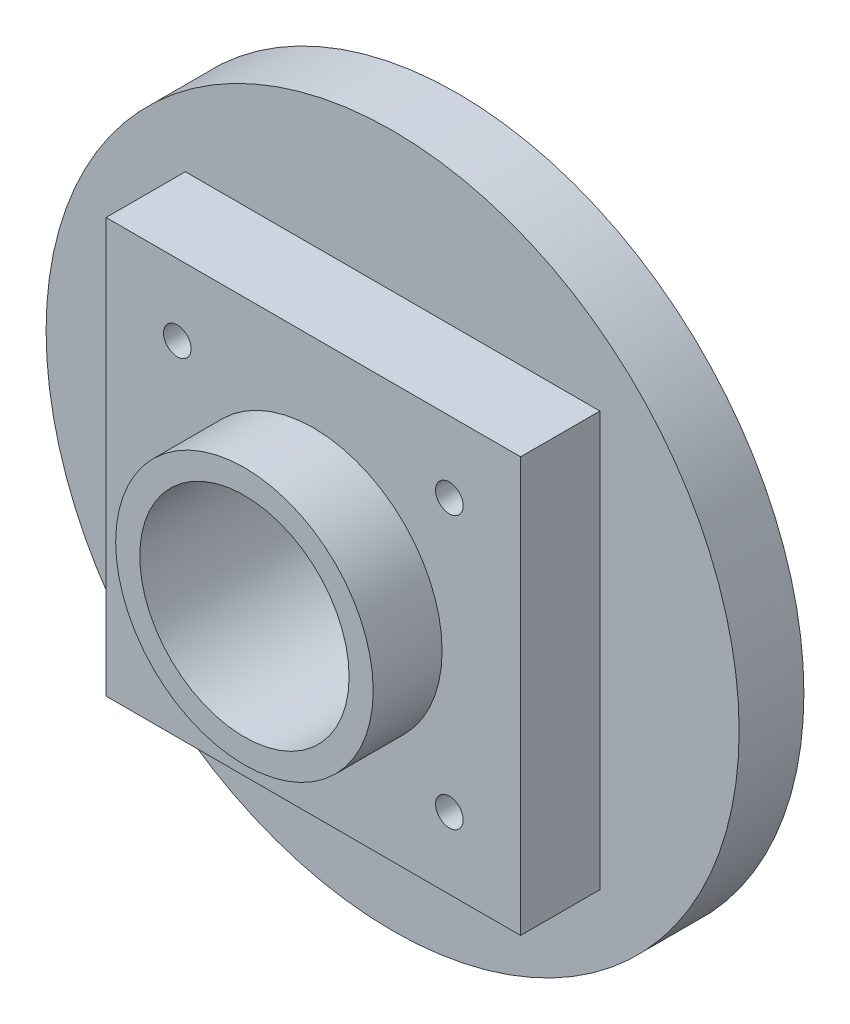
ISO-10303-21;
HEADER;
FILE_DESCRIPTION(('STEP AP214'),'2;1');
FILE_NAME('part.step','',(''),(''),'','','');
FILE_SCHEMA(('AUTOMOTIVE_DESIGN { 1 0 10303 214 1 1 1 1 }'));
ENDSEC;
DATA;
#1=APPLICATION_CONTEXT('core data for automotive mechanical design processes');
#2=APPLICATION_PROTOCOL_DEFINITION('international standard','automotive_design',2000,#1);
#3=PRODUCT_CONTEXT('',#1,'mechanical');
#4=PRODUCT('Part','Part','',(#3));
#5=PRODUCT_RELATED_PRODUCT_CATEGORY('part','',(#4));
#6=PRODUCT_DEFINITION_FORMATION('','',#4);
#7=PRODUCT_DEFINITION_CONTEXT('part definition',#1,'design');
#8=PRODUCT_DEFINITION('design','',#6,#7);
#9=PRODUCT_DEFINITION_SHAPE('','',#8);
#10=(LENGTH_UNIT() NAMED_UNIT(*) SI_UNIT(.MILLI.,.METRE.));
#11=(NAMED_UNIT(*) PLANE_ANGLE_UNIT() SI_UNIT($,.RADIAN.));
#12=(NAMED_UNIT(*) SI_UNIT($,.STERADIAN.) SOLID_ANGLE_UNIT());
#13=UNCERTAINTY_MEASURE_WITH_UNIT(LENGTH_MEASURE(1.E-05),#10,'distance_accuracy_value','');
#14=(GEOMETRIC_REPRESENTATION_CONTEXT(3) GLOBAL_UNCERTAINTY_ASSIGNED_CONTEXT((#13)) GLOBAL_UNIT_ASSIGNED_CONTEXT((#10,
#11,#12)) REPRESENTATION_CONTEXT('',''));
#15=CARTESIAN_POINT('',(0.,0.,0.));
#16=DIRECTION('',(0.,0.,1.));
#17=DIRECTION('',(1.,0.,0.));
#18=AXIS2_PLACEMENT_3D('',#15,#16,#17);
#19=CARTESIAN_POINT('',(0.,0.,14.1224));
#20=DIRECTION('',(0.,0.,1.));
#21=DIRECTION('',(1.,0.,0.));
#22=AXIS2_PLACEMENT_3D('',#19,#20,#21);
#23=PLANE('',#22);
#24=DIRECTION('',(0.,-1.,0.));
#25=VECTOR('',#24,1.);
#26=CARTESIAN_POINT('',(-20.32,20.32,14.1224));
#27=LINE('',#26,#25);
#28=CARTESIAN_POINT('',(-20.32,20.32,14.1224));
#29=VERTEX_POINT('',#28);
#30=CARTESIAN_POINT('',(-20.32,-20.32,14.1224));
#31=VERTEX_POINT('',#30);
#32=EDGE_CURVE('E133',#29,#31,#27,.T.);
#33=ORIENTED_EDGE('',*,*,#32,.T.);
#34=DIRECTION('',(1.,0.,0.));
#35=VECTOR('',#34,1.);
#36=CARTESIAN_POINT('',(-20.32,-20.32,14.1224));
#37=LINE('',#36,#35);
#38=CARTESIAN_POINT('',(20.32,-20.32,14.1224));
#39=VERTEX_POINT('',#38);
#40=EDGE_CURVE('E81',#31,#39,#37,.T.);
#41=ORIENTED_EDGE('',*,*,#40,.T.);
#42=DIRECTION('',(0.,1.,0.));
#43=VECTOR('',#42,1.);
#44=CARTESIAN_POINT('',(20.32,20.32,14.1224));
#45=LINE('',#44,#43);
#46=CARTESIAN_POINT('',(20.32,20.32,14.1224));
#47=VERTEX_POINT('',#46);
#48=EDGE_CURVE('E136',#39,#47,#45,.T.);
#49=ORIENTED_EDGE('',*,*,#48,.T.);
#50=DIRECTION('',(-1.,0.,0.));
#51=VECTOR('',#50,1.);
#52=CARTESIAN_POINT('',(-20.32,20.32,14.1224));
#53=LINE('',#52,#51);
#54=EDGE_CURVE('E59',#47,#29,#53,.T.);
#55=ORIENTED_EDGE('',*,*,#54,.T.);
#56=EDGE_LOOP('',(#33,#41,#49,#55));
#57=FACE_BOUND('',#56,.T.);
#58=CARTESIAN_POINT('',(-13.335,-13.335,14.1224));
#59=DIRECTION('',(0.,0.,1.));
#60=DIRECTION('',(1.,0.,0.));
#61=AXIS2_PLACEMENT_3D('',#58,#59,#60);
#62=CIRCLE('',#61,1.35254999999999);
#63=CARTESIAN_POINT('',(-11.98245,-13.335,14.1224));
#64=VERTEX_POINT('',#63);
#65=EDGE_CURVE('E123',#64,#64,#62,.T.);
#66=ORIENTED_EDGE('',*,*,#65,.F.);
#67=EDGE_LOOP('',(#66));
#68=FACE_BOUND('',#67,.T.);
#69=CARTESIAN_POINT('',(13.335,-13.335,14.1224));
#70=DIRECTION('',(0.,0.,1.));
#71=DIRECTION('',(1.,0.,0.));
#72=AXIS2_PLACEMENT_3D('',#69,#70,#71);
#73=CIRCLE('',#72,1.35254999999999);
#74=CARTESIAN_POINT('',(14.68755,-13.335,14.1224));
#75=VERTEX_POINT('',#74);
#76=EDGE_CURVE('E117',#75,#75,#73,.T.);
#77=ORIENTED_EDGE('',*,*,#76,.F.);
#78=EDGE_LOOP('',(#77));
#79=FACE_BOUND('',#78,.T.);
#80=CARTESIAN_POINT('',(13.335,13.335,14.1224));
#81=DIRECTION('',(0.,0.,1.));
#82=DIRECTION('',(1.,0.,0.));
#83=AXIS2_PLACEMENT_3D('',#80,#81,#82);
#84=CIRCLE('',#83,1.35254999999999);
#85=CARTESIAN_POINT('',(14.68755,13.335,14.1224));
#86=VERTEX_POINT('',#85);
#87=EDGE_CURVE('E104',#86,#86,#84,.T.);
#88=ORIENTED_EDGE('',*,*,#87,.F.);
#89=EDGE_LOOP('',(#88));
#90=FACE_BOUND('',#89,.T.);
#91=CARTESIAN_POINT('',(-13.335,13.335,14.1224));
#92=DIRECTION('',(0.,0.,1.));
#93=DIRECTION('',(1.,0.,0.));
#94=AXIS2_PLACEMENT_3D('',#91,#92,#93);
#95=CIRCLE('',#94,1.35254999999999);
#96=CARTESIAN_POINT('',(-11.98245,13.335,14.1224));
#97=VERTEX_POINT('',#96);
#98=EDGE_CURVE('E105',#97,#97,#95,.T.);
#99=ORIENTED_EDGE('',*,*,#98,.F.);
#100=EDGE_LOOP('',(#99));
#101=FACE_BOUND('',#100,.T.);
#102=CARTESIAN_POINT('',(0.,0.,14.1224));
#103=DIRECTION('',(0.,0.,1.));
#104=DIRECTION('',(1.,0.,0.));
#105=AXIS2_PLACEMENT_3D('',#102,#103,#104);
#106=CIRCLE('',#105,12.6238);
#107=CARTESIAN_POINT('',(12.6238,0.,14.1224));
#108=VERTEX_POINT('',#107);
#109=EDGE_CURVE('E219',#108,#108,#106,.T.);
#110=ORIENTED_EDGE('',*,*,#109,.F.);
#111=EDGE_LOOP('',(#110));
#112=FACE_BOUND('',#111,.T.);
#113=ADVANCED_FACE('F36',(#57,#68,#79,#90,#101,#112),#23,.T.);
#114=CARTESIAN_POINT('',(0.,0.,6.35));
#115=DIRECTION('',(0.,0.,1.));
#116=DIRECTION('',(1.,0.,0.));
#117=AXIS2_PLACEMENT_3D('',#114,#115,#116);
#118=PLANE('',#117);
#119=CARTESIAN_POINT('',(0.,0.,6.35));
#120=DIRECTION('',(0.,0.,1.));
#121=DIRECTION('',(1.,0.,0.));
#122=AXIS2_PLACEMENT_3D('',#119,#120,#121);
#123=CIRCLE('',#122,33.9725);
#124=CARTESIAN_POINT('',(33.9725,0.,6.35));
#125=VERTEX_POINT('',#124);
#126=EDGE_CURVE('E44',#125,#125,#123,.T.);
#127=ORIENTED_EDGE('',*,*,#126,.T.);
#128=EDGE_LOOP('',(#127));
#129=FACE_BOUND('',#128,.T.);
#130=DIRECTION('',(1.,0.,0.));
#131=VECTOR('',#130,1.);
#132=CARTESIAN_POINT('',(-20.32,-20.32,6.35));
#133=LINE('',#132,#131);
#134=CARTESIAN_POINT('',(-20.32,-20.32,6.35));
#135=VERTEX_POINT('',#134);
#136=CARTESIAN_POINT('',(20.32,-20.32,6.35));
#137=VERTEX_POINT('',#136);
#138=EDGE_CURVE('E142',#135,#137,#133,.T.);
#139=ORIENTED_EDGE('',*,*,#138,.F.);
#140=DIRECTION('',(0.,-1.,0.));
#141=VECTOR('',#140,1.);
#142=CARTESIAN_POINT('',(-20.32,20.32,6.35));
#143=LINE('',#142,#141);
#144=CARTESIAN_POINT('',(-20.32,20.32,6.35));
#145=VERTEX_POINT('',#144);
#146=EDGE_CURVE('E132',#145,#135,#143,.T.);
#147=ORIENTED_EDGE('',*,*,#146,.F.);
#148=DIRECTION('',(-1.,0.,0.));
#149=VECTOR('',#148,1.);
#150=CARTESIAN_POINT('',(-20.32,20.32,6.35));
#151=LINE('',#150,#149);
#152=CARTESIAN_POINT('',(20.32,20.32,6.35));
#153=VERTEX_POINT('',#152);
#154=EDGE_CURVE('E74',#153,#145,#151,.T.);
#155=ORIENTED_EDGE('',*,*,#154,.F.);
#156=DIRECTION('',(0.,1.,0.));
#157=VECTOR('',#156,1.);
#158=CARTESIAN_POINT('',(20.32,20.32,6.35));
#159=LINE('',#158,#157);
#160=EDGE_CURVE('E144',#137,#153,#159,.T.);
#161=ORIENTED_EDGE('',*,*,#160,.F.);
#162=EDGE_LOOP('',(#139,#147,#155,#161));
#163=FACE_BOUND('',#162,.T.);
#164=ADVANCED_FACE('F174',(#129,#163),#118,.T.);
#165=CARTESIAN_POINT('',(0.,0.,6.35));
#166=DIRECTION('',(0.,0.,-1.));
#167=DIRECTION('',(-1.,0.,0.));
#168=AXIS2_PLACEMENT_3D('',#165,#166,#167);
#169=CYLINDRICAL_SURFACE('',#168,33.9725);
#170=ORIENTED_EDGE('',*,*,#126,.F.);
#171=EDGE_LOOP('',(#170));
#172=FACE_BOUND('',#171,.T.);
#173=CARTESIAN_POINT('',(0.,0.,0.));
#174=DIRECTION('',(0.,0.,1.));
#175=DIRECTION('',(1.,0.,0.));
#176=AXIS2_PLACEMENT_3D('',#173,#174,#175);
#177=CIRCLE('',#176,33.9725);
#178=CARTESIAN_POINT('',(33.9725,0.,0.));
#179=VERTEX_POINT('',#178);
#180=EDGE_CURVE('E157',#179,#179,#177,.T.);
#181=ORIENTED_EDGE('',*,*,#180,.T.);
#182=EDGE_LOOP('',(#181));
#183=FACE_BOUND('',#182,.T.);
#184=ADVANCED_FACE('F38',(#172,#183),#169,.T.);
#185=CARTESIAN_POINT('',(0.,0.,0.));
#186=DIRECTION('',(0.,0.,1.));
#187=DIRECTION('',(1.,0.,0.));
#188=AXIS2_PLACEMENT_3D('',#185,#186,#187);
#189=PLANE('',#188);
#190=CARTESIAN_POINT('',(0.,0.,0.));
#191=DIRECTION('',(0.,0.,1.));
#192=DIRECTION('',(1.,0.,0.));
#193=AXIS2_PLACEMENT_3D('',#190,#191,#192);
#194=CIRCLE('',#193,17.145);
#195=CARTESIAN_POINT('',(17.145,0.,0.));
#196=VERTEX_POINT('',#195);
#197=EDGE_CURVE('E11',#196,#196,#194,.F.);
#198=ORIENTED_EDGE('',*,*,#197,.F.);
#199=EDGE_LOOP('',(#198));
#200=FACE_BOUND('',#199,.T.);
#201=ORIENTED_EDGE('',*,*,#180,.F.);
#202=EDGE_LOOP('',(#201));
#203=FACE_BOUND('',#202,.T.);
#204=ADVANCED_FACE('F163',(#200,#203),#189,.F.);
#205=CARTESIAN_POINT('',(0.,0.,-6.985));
#206=DIRECTION('',(0.,0.,1.));
#207=DIRECTION('',(1.,0.,0.));
#208=AXIS2_PLACEMENT_3D('',#205,#206,#207);
#209=CYLINDRICAL_SURFACE('',#208,17.145);
#210=CARTESIAN_POINT('',(0.,0.,-6.985));
#211=DIRECTION('',(0.,0.,-1.));
#212=DIRECTION('',(-1.,0.,0.));
#213=AXIS2_PLACEMENT_3D('',#210,#211,#212);
#214=CIRCLE('',#213,17.145);
#215=CARTESIAN_POINT('',(-17.145,0.,-6.985));
#216=VERTEX_POINT('',#215);
#217=EDGE_CURVE('E154',#216,#216,#214,.T.);
#218=ORIENTED_EDGE('',*,*,#217,.F.);
#219=EDGE_LOOP('',(#218));
#220=FACE_BOUND('',#219,.T.);
#221=ORIENTED_EDGE('',*,*,#197,.T.);
#222=EDGE_LOOP('',(#221));
#223=FACE_BOUND('',#222,.T.);
#224=ADVANCED_FACE('F165',(#220,#223),#209,.T.);
#225=CARTESIAN_POINT('',(0.,0.,-6.985));
#226=DIRECTION('',(0.,0.,-1.));
#227=DIRECTION('',(-1.,0.,0.));
#228=AXIS2_PLACEMENT_3D('',#225,#226,#227);
#229=PLANE('',#228);
#230=CARTESIAN_POINT('',(0.,0.,-6.985));
#231=DIRECTION('',(0.,0.,1.));
#232=DIRECTION('',(1.,0.,0.));
#233=AXIS2_PLACEMENT_3D('',#230,#231,#232);
#234=CIRCLE('',#233,10.2616);
#235=CARTESIAN_POINT('',(10.2616,0.,-6.985));
#236=VERTEX_POINT('',#235);
#237=EDGE_CURVE('E129',#236,#236,#234,.T.);
#238=ORIENTED_EDGE('',*,*,#237,.T.);
#239=EDGE_LOOP('',(#238));
#240=FACE_BOUND('',#239,.T.);
#241=ORIENTED_EDGE('',*,*,#217,.T.);
#242=EDGE_LOOP('',(#241));
#243=FACE_BOUND('',#242,.T.);
#244=ADVANCED_FACE('F171',(#240,#243),#229,.T.);
#245=CARTESIAN_POINT('',(-20.32,20.32,14.1224));
#246=DIRECTION('',(1.,0.,0.));
#247=DIRECTION('',(0.,0.,-1.));
#248=AXIS2_PLACEMENT_3D('',#245,#246,#247);
#249=PLANE('',#248);
#250=ORIENTED_EDGE('',*,*,#146,.T.);
#251=DIRECTION('',(0.,0.,-1.));
#252=VECTOR('',#251,1.);
#253=CARTESIAN_POINT('',(-20.32,-20.32,14.1224));
#254=LINE('',#253,#252);
#255=EDGE_CURVE('E152',#31,#135,#254,.T.);
#256=ORIENTED_EDGE('',*,*,#255,.F.);
#257=ORIENTED_EDGE('',*,*,#32,.F.);
#258=DIRECTION('',(0.,0.,-1.));
#259=VECTOR('',#258,1.);
#260=CARTESIAN_POINT('',(-20.32,20.32,14.1224));
#261=LINE('',#260,#259);
#262=EDGE_CURVE('E139',#29,#145,#261,.T.);
#263=ORIENTED_EDGE('',*,*,#262,.T.);
#264=EDGE_LOOP('',(#250,#256,#257,#263));
#265=FACE_BOUND('',#264,.T.);
#266=ADVANCED_FACE('F199',(#265),#249,.F.);
#267=CARTESIAN_POINT('',(-20.32,-20.32,14.1224));
#268=DIRECTION('',(0.,1.,0.));
#269=DIRECTION('',(-1.,0.,0.));
#270=AXIS2_PLACEMENT_3D('',#267,#268,#269);
#271=PLANE('',#270);
#272=ORIENTED_EDGE('',*,*,#138,.T.);
#273=DIRECTION('',(0.,0.,-1.));
#274=VECTOR('',#273,1.);
#275=CARTESIAN_POINT('',(20.32,-20.32,14.1224));
#276=LINE('',#275,#274);
#277=EDGE_CURVE('E149',#39,#137,#276,.T.);
#278=ORIENTED_EDGE('',*,*,#277,.F.);
#279=ORIENTED_EDGE('',*,*,#40,.F.);
#280=ORIENTED_EDGE('',*,*,#255,.T.);
#281=EDGE_LOOP('',(#272,#278,#279,#280));
#282=FACE_BOUND('',#281,.T.);
#283=ADVANCED_FACE('F195',(#282),#271,.F.);
#284=CARTESIAN_POINT('',(20.32,20.32,14.1224));
#285=DIRECTION('',(-1.,0.,0.));
#286=DIRECTION('',(0.,-1.,0.));
#287=AXIS2_PLACEMENT_3D('',#284,#285,#286);
#288=PLANE('',#287);
#289=ORIENTED_EDGE('',*,*,#160,.T.);
#290=DIRECTION('',(0.,0.,-1.));
#291=VECTOR('',#290,1.);
#292=CARTESIAN_POINT('',(20.32,20.32,14.1224));
#293=LINE('',#292,#291);
#294=EDGE_CURVE('E51',#47,#153,#293,.T.);
#295=ORIENTED_EDGE('',*,*,#294,.F.);
#296=ORIENTED_EDGE('',*,*,#48,.F.);
#297=ORIENTED_EDGE('',*,*,#277,.T.);
#298=EDGE_LOOP('',(#289,#295,#296,#297));
#299=FACE_BOUND('',#298,.T.);
#300=ADVANCED_FACE('F192',(#299),#288,.F.);
#301=CARTESIAN_POINT('',(-20.32,20.32,14.1224));
#302=DIRECTION('',(0.,-1.,0.));
#303=DIRECTION('',(1.,0.,0.));
#304=AXIS2_PLACEMENT_3D('',#301,#302,#303);
#305=PLANE('',#304);
#306=ORIENTED_EDGE('',*,*,#154,.T.);
#307=ORIENTED_EDGE('',*,*,#262,.F.);
#308=ORIENTED_EDGE('',*,*,#54,.F.);
#309=ORIENTED_EDGE('',*,*,#294,.T.);
#310=EDGE_LOOP('',(#306,#307,#308,#309));
#311=FACE_BOUND('',#310,.T.);
#312=ADVANCED_FACE('F189',(#311),#305,.F.);
#313=CARTESIAN_POINT('',(0.,0.,-6.985));
#314=DIRECTION('',(0.,0.,1.));
#315=DIRECTION('',(1.,0.,0.));
#316=AXIS2_PLACEMENT_3D('',#313,#314,#315);
#317=CYLINDRICAL_SURFACE('',#316,10.2616);
#318=ORIENTED_EDGE('',*,*,#237,.F.);
#319=EDGE_LOOP('',(#318));
#320=FACE_BOUND('',#319,.T.);
#321=CARTESIAN_POINT('',(0.,0.,20.8788));
#322=DIRECTION('',(0.,0.,1.));
#323=DIRECTION('',(1.,0.,0.));
#324=AXIS2_PLACEMENT_3D('',#321,#322,#323);
#325=CIRCLE('',#324,10.2616);
#326=CARTESIAN_POINT('',(10.2616,0.,20.8788));
#327=VERTEX_POINT('',#326);
#328=EDGE_CURVE('E217',#327,#327,#325,.T.);
#329=ORIENTED_EDGE('',*,*,#328,.T.);
#330=EDGE_LOOP('',(#329));
#331=FACE_BOUND('',#330,.T.);
#332=ADVANCED_FACE('F187',(#320,#331),#317,.F.);
#333=CARTESIAN_POINT('',(-13.335,-13.335,4.72439999999999));
#334=DIRECTION('',(0.,0.,1.));
#335=DIRECTION('',(1.,0.,0.));
#336=AXIS2_PLACEMENT_3D('',#333,#334,#335);
#337=CONICAL_SURFACE('',#336,1.35254999999999,1.02974425867665);
#338=CARTESIAN_POINT('',(-13.335,-13.335,3.91170596973427));
#339=VERTEX_POINT('',#338);
#340=VERTEX_LOOP('',#339);
#341=FACE_BOUND('',#340,.T.);
#342=CARTESIAN_POINT('',(-13.335,-13.335,4.72439999999999));
#343=DIRECTION('',(0.,0.,1.));
#344=DIRECTION('',(1.,0.,0.));
#345=AXIS2_PLACEMENT_3D('',#342,#343,#344);
#346=CIRCLE('',#345,1.35254999999999);
#347=CARTESIAN_POINT('',(-11.98245,-13.335,4.72439999999999));
#348=VERTEX_POINT('',#347);
#349=EDGE_CURVE('E126',#348,#348,#346,.T.);
#350=ORIENTED_EDGE('',*,*,#349,.T.);
#351=EDGE_LOOP('',(#350));
#352=FACE_BOUND('',#351,.T.);
#353=ADVANCED_FACE('F214',(#341,#352),#337,.F.);
#354=CARTESIAN_POINT('',(-13.335,-13.335,14.1224));
#355=DIRECTION('',(0.,0.,1.));
#356=DIRECTION('',(1.,0.,0.));
#357=AXIS2_PLACEMENT_3D('',#354,#355,#356);
#358=CYLINDRICAL_SURFACE('',#357,1.35254999999999);
#359=ORIENTED_EDGE('',*,*,#349,.F.);
#360=EDGE_LOOP('',(#359));
#361=FACE_BOUND('',#360,.T.);
#362=ORIENTED_EDGE('',*,*,#65,.T.);
#363=EDGE_LOOP('',(#362));
#364=FACE_BOUND('',#363,.T.);
#365=ADVANCED_FACE('F255',(#361,#364),#358,.F.);
#366=CARTESIAN_POINT('',(13.335,-13.335,4.72439999999999));
#367=DIRECTION('',(0.,0.,1.));
#368=DIRECTION('',(1.,0.,0.));
#369=AXIS2_PLACEMENT_3D('',#366,#367,#368);
#370=CONICAL_SURFACE('',#369,1.35254999999999,1.02974425867665);
#371=CARTESIAN_POINT('',(13.335,-13.335,3.91170596973427));
#372=VERTEX_POINT('',#371);
#373=VERTEX_LOOP('',#372);
#374=FACE_BOUND('',#373,.T.);
#375=CARTESIAN_POINT('',(13.335,-13.335,4.72439999999999));
#376=DIRECTION('',(0.,0.,1.));
#377=DIRECTION('',(1.,0.,0.));
#378=AXIS2_PLACEMENT_3D('',#375,#376,#377);
#379=CIRCLE('',#378,1.35254999999999);
#380=CARTESIAN_POINT('',(14.68755,-13.335,4.72439999999999));
#381=VERTEX_POINT('',#380);
#382=EDGE_CURVE('E120',#381,#381,#379,.T.);
#383=ORIENTED_EDGE('',*,*,#382,.T.);
#384=EDGE_LOOP('',(#383));
#385=FACE_BOUND('',#384,.T.);
#386=ADVANCED_FACE('F251',(#374,#385),#370,.F.);
#387=CARTESIAN_POINT('',(13.335,-13.335,14.1224));
#388=DIRECTION('',(0.,0.,1.));
#389=DIRECTION('',(1.,0.,0.));
#390=AXIS2_PLACEMENT_3D('',#387,#388,#389);
#391=CYLINDRICAL_SURFACE('',#390,1.35254999999999);
#392=ORIENTED_EDGE('',*,*,#382,.F.);
#393=EDGE_LOOP('',(#392));
#394=FACE_BOUND('',#393,.T.);
#395=ORIENTED_EDGE('',*,*,#76,.T.);
#396=EDGE_LOOP('',(#395));
#397=FACE_BOUND('',#396,.T.);
#398=ADVANCED_FACE('F247',(#394,#397),#391,.F.);
#399=CARTESIAN_POINT('',(13.335,13.335,4.72439999999999));
#400=DIRECTION('',(0.,0.,1.));
#401=DIRECTION('',(1.,0.,0.));
#402=AXIS2_PLACEMENT_3D('',#399,#400,#401);
#403=CONICAL_SURFACE('',#402,1.35254999999999,1.02974425867665);
#404=CARTESIAN_POINT('',(13.335,13.335,3.91170596973427));
#405=VERTEX_POINT('',#404);
#406=VERTEX_LOOP('',#405);
#407=FACE_BOUND('',#406,.T.);
#408=CARTESIAN_POINT('',(13.335,13.335,4.72439999999999));
#409=DIRECTION('',(0.,0.,1.));
#410=DIRECTION('',(1.,0.,0.));
#411=AXIS2_PLACEMENT_3D('',#408,#409,#410);
#412=CIRCLE('',#411,1.35254999999999);
#413=CARTESIAN_POINT('',(14.68755,13.335,4.72439999999999));
#414=VERTEX_POINT('',#413);
#415=EDGE_CURVE('E108',#414,#414,#412,.T.);
#416=ORIENTED_EDGE('',*,*,#415,.T.);
#417=EDGE_LOOP('',(#416));
#418=FACE_BOUND('',#417,.T.);
#419=ADVANCED_FACE('F243',(#407,#418),#403,.F.);
#420=CARTESIAN_POINT('',(13.335,13.335,14.1224));
#421=DIRECTION('',(0.,0.,1.));
#422=DIRECTION('',(1.,0.,0.));
#423=AXIS2_PLACEMENT_3D('',#420,#421,#422);
#424=CYLINDRICAL_SURFACE('',#423,1.35254999999999);
#425=ORIENTED_EDGE('',*,*,#415,.F.);
#426=EDGE_LOOP('',(#425));
#427=FACE_BOUND('',#426,.T.);
#428=ORIENTED_EDGE('',*,*,#87,.T.);
#429=EDGE_LOOP('',(#428));
#430=FACE_BOUND('',#429,.T.);
#431=ADVANCED_FACE('F98',(#427,#430),#424,.F.);
#432=CARTESIAN_POINT('',(-13.335,13.335,4.72439999999999));
#433=DIRECTION('',(0.,0.,1.));
#434=DIRECTION('',(1.,0.,0.));
#435=AXIS2_PLACEMENT_3D('',#432,#433,#434);
#436=CONICAL_SURFACE('',#435,1.35254999999999,1.02974425867665);
#437=CARTESIAN_POINT('',(-13.335,13.335,3.91170596973427));
#438=VERTEX_POINT('',#437);
#439=VERTEX_LOOP('',#438);
#440=FACE_BOUND('',#439,.T.);
#441=CARTESIAN_POINT('',(-13.335,13.335,4.72439999999999));
#442=DIRECTION('',(0.,0.,1.));
#443=DIRECTION('',(1.,0.,0.));
#444=AXIS2_PLACEMENT_3D('',#441,#442,#443);
#445=CIRCLE('',#444,1.35254999999999);
#446=CARTESIAN_POINT('',(-11.98245,13.335,4.72439999999999));
#447=VERTEX_POINT('',#446);
#448=EDGE_CURVE('E102',#447,#447,#445,.T.);
#449=ORIENTED_EDGE('',*,*,#448,.T.);
#450=EDGE_LOOP('',(#449));
#451=FACE_BOUND('',#450,.T.);
#452=ADVANCED_FACE('F94',(#440,#451),#436,.F.);
#453=CARTESIAN_POINT('',(-13.335,13.335,14.1224));
#454=DIRECTION('',(0.,0.,1.));
#455=DIRECTION('',(1.,0.,0.));
#456=AXIS2_PLACEMENT_3D('',#453,#454,#455);
#457=CYLINDRICAL_SURFACE('',#456,1.35254999999999);
#458=ORIENTED_EDGE('',*,*,#448,.F.);
#459=EDGE_LOOP('',(#458));
#460=FACE_BOUND('',#459,.T.);
#461=ORIENTED_EDGE('',*,*,#98,.T.);
#462=EDGE_LOOP('',(#461));
#463=FACE_BOUND('',#462,.T.);
#464=ADVANCED_FACE('F97',(#460,#463),#457,.F.);
#465=CARTESIAN_POINT('',(0.,0.,20.8788));
#466=DIRECTION('',(0.,0.,1.));
#467=DIRECTION('',(1.,0.,0.));
#468=AXIS2_PLACEMENT_3D('',#465,#466,#467);
#469=PLANE('',#468);
#470=CARTESIAN_POINT('',(0.,0.,20.8788));
#471=DIRECTION('',(0.,0.,1.));
#472=DIRECTION('',(1.,0.,0.));
#473=AXIS2_PLACEMENT_3D('',#470,#471,#472);
#474=CIRCLE('',#473,12.6238);
#475=CARTESIAN_POINT('',(12.6238,0.,20.8788));
#476=VERTEX_POINT('',#475);
#477=EDGE_CURVE('E111',#476,#476,#474,.T.);
#478=ORIENTED_EDGE('',*,*,#477,.T.);
#479=EDGE_LOOP('',(#478));
#480=FACE_BOUND('',#479,.T.);
#481=ORIENTED_EDGE('',*,*,#328,.F.);
#482=EDGE_LOOP('',(#481));
#483=FACE_BOUND('',#482,.T.);
#484=ADVANCED_FACE('F226',(#480,#483),#469,.T.);
#485=CARTESIAN_POINT('',(0.,0.,20.8788));
#486=DIRECTION('',(0.,0.,-1.));
#487=DIRECTION('',(-1.,0.,0.));
#488=AXIS2_PLACEMENT_3D('',#485,#486,#487);
#489=CYLINDRICAL_SURFACE('',#488,12.6238);
#490=ORIENTED_EDGE('',*,*,#477,.F.);
#491=EDGE_LOOP('',(#490));
#492=FACE_BOUND('',#491,.T.);
#493=ORIENTED_EDGE('',*,*,#109,.T.);
#494=EDGE_LOOP('',(#493));
#495=FACE_BOUND('',#494,.T.);
#496=ADVANCED_FACE('F228',(#492,#495),#489,.T.);
#497=CLOSED_SHELL('',(#113,#164,#184,#204,#224,#244,#266,#283,#300,#312,#332,#353,#365,#386,
#398,#419,#431,#452,#464,#484,#496));
#498=MANIFOLD_SOLID_BREP('B2',#497);
#499=ADVANCED_BREP_SHAPE_REPRESENTATION('',(#18,#498),#14);
#500=SHAPE_DEFINITION_REPRESENTATION(#9,#499);
ENDSEC;
END-ISO-10303-21;
